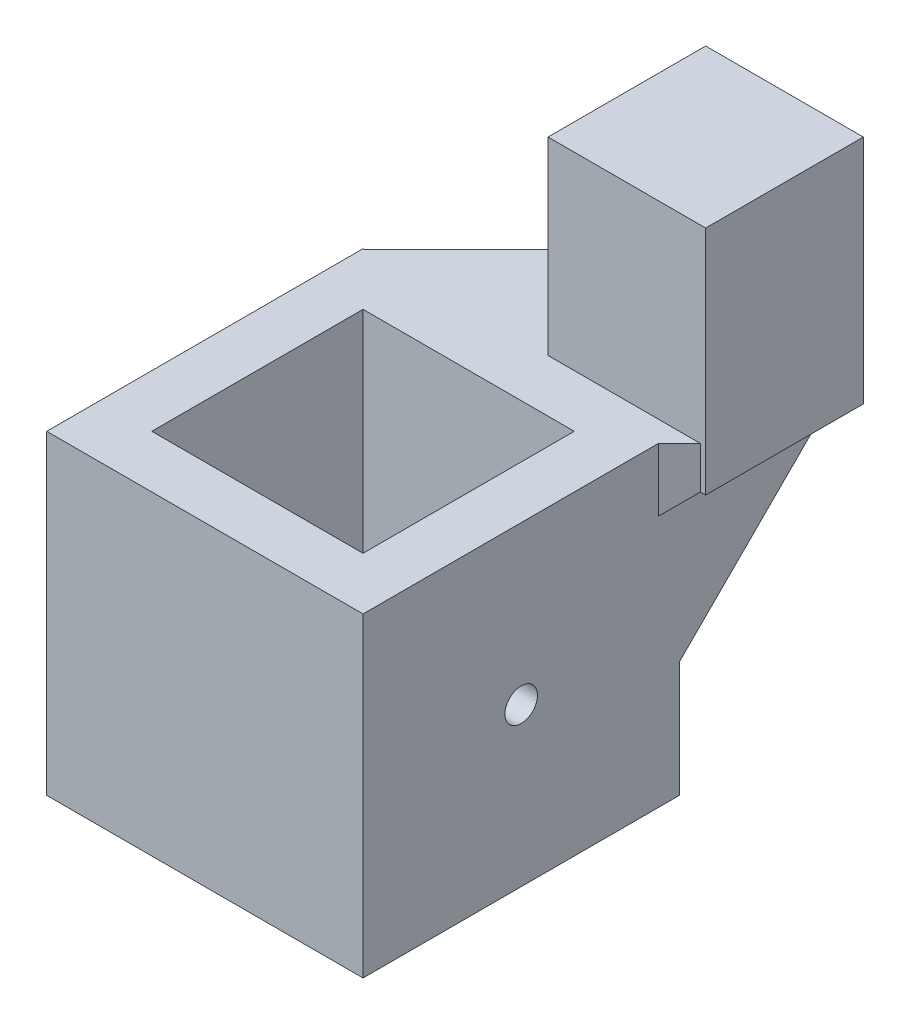
ISO-10303-21;
HEADER;
FILE_DESCRIPTION(('STEP AP214'),'2;1');
FILE_NAME('part.step','',(''),(''),'','','');
FILE_SCHEMA(('AUTOMOTIVE_DESIGN { 1 0 10303 214 1 1 1 1 }'));
ENDSEC;
DATA;
#1=APPLICATION_CONTEXT('core data for automotive mechanical design processes');
#2=APPLICATION_PROTOCOL_DEFINITION('international standard','automotive_design',2000,#1);
#3=PRODUCT_CONTEXT('',#1,'mechanical');
#4=PRODUCT('Part','Part','',(#3));
#5=PRODUCT_RELATED_PRODUCT_CATEGORY('part','',(#4));
#6=PRODUCT_DEFINITION_FORMATION('','',#4);
#7=PRODUCT_DEFINITION_CONTEXT('part definition',#1,'design');
#8=PRODUCT_DEFINITION('design','',#6,#7);
#9=PRODUCT_DEFINITION_SHAPE('','',#8);
#10=(LENGTH_UNIT() NAMED_UNIT(*) SI_UNIT(.MILLI.,.METRE.));
#11=(NAMED_UNIT(*) PLANE_ANGLE_UNIT() SI_UNIT($,.RADIAN.));
#12=(NAMED_UNIT(*) SI_UNIT($,.STERADIAN.) SOLID_ANGLE_UNIT());
#13=UNCERTAINTY_MEASURE_WITH_UNIT(LENGTH_MEASURE(1.E-05),#10,'distance_accuracy_value','');
#14=(GEOMETRIC_REPRESENTATION_CONTEXT(3) GLOBAL_UNCERTAINTY_ASSIGNED_CONTEXT((#13)) GLOBAL_UNIT_ASSIGNED_CONTEXT((#10,
#11,#12)) REPRESENTATION_CONTEXT('',''));
#15=CARTESIAN_POINT('',(0.,0.,0.));
#16=DIRECTION('',(0.,0.,1.));
#17=DIRECTION('',(1.,0.,0.));
#18=AXIS2_PLACEMENT_3D('',#15,#16,#17);
#19=CARTESIAN_POINT('',(0.,305.,-25.1));
#20=DIRECTION('',(0.,0.,1.));
#21=DIRECTION('',(1.,0.,0.));
#22=AXIS2_PLACEMENT_3D('',#19,#20,#21);
#23=PLANE('',#22);
#24=DIRECTION('',(1.,0.,0.));
#25=VECTOR('',#24,1.);
#26=CARTESIAN_POINT('',(0.,325.,-25.1));
#27=LINE('',#26,#25);
#28=CARTESIAN_POINT('',(-25.1,325.,-25.1));
#29=VERTEX_POINT('',#28);
#30=CARTESIAN_POINT('',(-25.0000000000001,325.,-25.1));
#31=VERTEX_POINT('',#30);
#32=EDGE_CURVE('E251',#29,#31,#27,.T.);
#33=ORIENTED_EDGE('',*,*,#32,.T.);
#34=DIRECTION('',(0.,-1.,0.));
#35=VECTOR('',#34,1.);
#36=CARTESIAN_POINT('',(-25.0000000000001,305.,-25.1));
#37=LINE('',#36,#35);
#38=CARTESIAN_POINT('',(-25.0000000000001,306.,-25.1));
#39=VERTEX_POINT('',#38);
#40=EDGE_CURVE('E298',#31,#39,#37,.T.);
#41=ORIENTED_EDGE('',*,*,#40,.T.);
#42=DIRECTION('',(1.,0.,0.));
#43=VECTOR('',#42,1.);
#44=CARTESIAN_POINT('',(0.,306.,-25.1));
#45=LINE('',#44,#43);
#46=CARTESIAN_POINT('',(5.,306.,-25.1));
#47=VERTEX_POINT('',#46);
#48=EDGE_CURVE('E275',#39,#47,#45,.T.);
#49=ORIENTED_EDGE('',*,*,#48,.T.);
#50=DIRECTION('',(0.,1.,0.));
#51=VECTOR('',#50,1.);
#52=CARTESIAN_POINT('',(5.,305.,-25.1));
#53=LINE('',#52,#51);
#54=CARTESIAN_POINT('',(5.,295.,-25.1));
#55=VERTEX_POINT('',#54);
#56=EDGE_CURVE('E272',#55,#47,#53,.T.);
#57=ORIENTED_EDGE('',*,*,#56,.F.);
#58=DIRECTION('',(1.,0.,0.));
#59=VECTOR('',#58,1.);
#60=CARTESIAN_POINT('',(0.,295.,-25.1));
#61=LINE('',#60,#59);
#62=CARTESIAN_POINT('',(-25.1,295.,-25.1));
#63=VERTEX_POINT('',#62);
#64=EDGE_CURVE('E228',#63,#55,#61,.T.);
#65=ORIENTED_EDGE('',*,*,#64,.F.);
#66=DIRECTION('',(0.,1.,0.));
#67=VECTOR('',#66,1.);
#68=CARTESIAN_POINT('',(-25.1,305.,-25.1));
#69=LINE('',#68,#67);
#70=EDGE_CURVE('E287',#63,#29,#69,.T.);
#71=ORIENTED_EDGE('',*,*,#70,.T.);
#72=EDGE_LOOP('',(#33,#41,#49,#57,#65,#71));
#73=FACE_BOUND('',#72,.T.);
#74=ADVANCED_FACE('F45',(#73),#23,.F.);
#75=CARTESIAN_POINT('',(0.,295.,0.));
#76=DIRECTION('',(0.,1.,0.));
#77=DIRECTION('',(0.,0.,1.));
#78=AXIS2_PLACEMENT_3D('',#75,#76,#77);
#79=PLANE('',#78);
#80=DIRECTION('',(0.,0.,1.));
#81=VECTOR('',#80,1.);
#82=CARTESIAN_POINT('',(5.,295.,0.));
#83=LINE('',#82,#81);
#84=CARTESIAN_POINT('',(5.,295.,5.));
#85=VERTEX_POINT('',#84);
#86=EDGE_CURVE('E225',#55,#85,#83,.T.);
#87=ORIENTED_EDGE('',*,*,#86,.T.);
#88=DIRECTION('',(1.,0.,0.));
#89=VECTOR('',#88,1.);
#90=CARTESIAN_POINT('',(0.,295.,5.));
#91=LINE('',#90,#89);
#92=CARTESIAN_POINT('',(-25.1,295.,5.));
#93=VERTEX_POINT('',#92);
#94=EDGE_CURVE('E234',#93,#85,#91,.T.);
#95=ORIENTED_EDGE('',*,*,#94,.F.);
#96=DIRECTION('',(0.,0.,1.));
#97=VECTOR('',#96,1.);
#98=CARTESIAN_POINT('',(-25.1,295.,0.));
#99=LINE('',#98,#97);
#100=EDGE_CURVE('E231',#63,#93,#99,.T.);
#101=ORIENTED_EDGE('',*,*,#100,.F.);
#102=ORIENTED_EDGE('',*,*,#64,.T.);
#103=EDGE_LOOP('',(#87,#95,#101,#102));
#104=FACE_BOUND('',#103,.T.);
#105=DIRECTION('',(1.,0.,0.));
#106=VECTOR('',#105,1.);
#107=CARTESIAN_POINT('',(0.,295.,-20.1));
#108=LINE('',#107,#106);
#109=CARTESIAN_POINT('',(-20.1,295.,-20.1));
#110=VERTEX_POINT('',#109);
#111=CARTESIAN_POINT('',(0.,295.,-20.1));
#112=VERTEX_POINT('',#111);
#113=EDGE_CURVE('E237',#110,#112,#108,.T.);
#114=ORIENTED_EDGE('',*,*,#113,.F.);
#115=DIRECTION('',(0.,0.,1.));
#116=VECTOR('',#115,1.);
#117=CARTESIAN_POINT('',(-20.1,295.,0.));
#118=LINE('',#117,#116);
#119=CARTESIAN_POINT('',(-20.1,295.,0.));
#120=VERTEX_POINT('',#119);
#121=EDGE_CURVE('E246',#110,#120,#118,.T.);
#122=ORIENTED_EDGE('',*,*,#121,.T.);
#123=DIRECTION('',(1.,0.,0.));
#124=VECTOR('',#123,1.);
#125=CARTESIAN_POINT('',(0.,295.,0.));
#126=LINE('',#125,#124);
#127=CARTESIAN_POINT('',(0.,295.,0.));
#128=VERTEX_POINT('',#127);
#129=EDGE_CURVE('E243',#120,#128,#126,.T.);
#130=ORIENTED_EDGE('',*,*,#129,.T.);
#131=DIRECTION('',(0.,0.,1.));
#132=VECTOR('',#131,1.);
#133=CARTESIAN_POINT('',(0.,295.,0.));
#134=LINE('',#133,#132);
#135=EDGE_CURVE('E240',#112,#128,#134,.T.);
#136=ORIENTED_EDGE('',*,*,#135,.F.);
#137=EDGE_LOOP('',(#114,#122,#130,#136));
#138=FACE_BOUND('',#137,.T.);
#139=ADVANCED_FACE('F340',(#104,#138),#79,.F.);
#140=CARTESIAN_POINT('',(-20.1,305.,0.));
#141=DIRECTION('',(-1.,0.,0.));
#142=DIRECTION('',(0.,0.,1.));
#143=AXIS2_PLACEMENT_3D('',#140,#141,#142);
#144=PLANE('',#143);
#145=CARTESIAN_POINT('',(-20.1,310.,-10.05));
#146=DIRECTION('',(-1.,0.,0.));
#147=DIRECTION('',(0.,0.,1.));
#148=AXIS2_PLACEMENT_3D('',#145,#146,#147);
#149=CIRCLE('',#148,1.55000000000003);
#150=CARTESIAN_POINT('',(-20.1,310.,-8.49999999999996));
#151=VERTEX_POINT('',#150);
#152=EDGE_CURVE('E222',#151,#151,#149,.T.);
#153=ORIENTED_EDGE('',*,*,#152,.T.);
#154=EDGE_LOOP('',(#153));
#155=FACE_BOUND('',#154,.T.);
#156=DIRECTION('',(0.,1.,0.));
#157=VECTOR('',#156,1.);
#158=CARTESIAN_POINT('',(-20.1,305.,-20.1));
#159=LINE('',#158,#157);
#160=CARTESIAN_POINT('',(-20.1,325.,-20.1));
#161=VERTEX_POINT('',#160);
#162=EDGE_CURVE('E273',#110,#161,#159,.T.);
#163=ORIENTED_EDGE('',*,*,#162,.T.);
#164=DIRECTION('',(0.,0.,1.));
#165=VECTOR('',#164,1.);
#166=CARTESIAN_POINT('',(-20.1,325.,0.));
#167=LINE('',#166,#165);
#168=CARTESIAN_POINT('',(-20.1,325.,0.));
#169=VERTEX_POINT('',#168);
#170=EDGE_CURVE('E269',#161,#169,#167,.T.);
#171=ORIENTED_EDGE('',*,*,#170,.T.);
#172=DIRECTION('',(0.,1.,0.));
#173=VECTOR('',#172,1.);
#174=CARTESIAN_POINT('',(-20.1,305.,0.));
#175=LINE('',#174,#173);
#176=EDGE_CURVE('E276',#120,#169,#175,.T.);
#177=ORIENTED_EDGE('',*,*,#176,.F.);
#178=ORIENTED_EDGE('',*,*,#121,.F.);
#179=EDGE_LOOP('',(#163,#171,#177,#178));
#180=FACE_BOUND('',#179,.T.);
#181=ADVANCED_FACE('F370',(#155,#180),#144,.F.);
#182=CARTESIAN_POINT('',(0.,305.,0.));
#183=DIRECTION('',(0.,0.,1.));
#184=DIRECTION('',(1.,0.,0.));
#185=AXIS2_PLACEMENT_3D('',#182,#183,#184);
#186=PLANE('',#185);
#187=ORIENTED_EDGE('',*,*,#176,.T.);
#188=DIRECTION('',(1.,0.,0.));
#189=VECTOR('',#188,1.);
#190=CARTESIAN_POINT('',(0.,325.,0.));
#191=LINE('',#190,#189);
#192=CARTESIAN_POINT('',(0.,325.,0.));
#193=VERTEX_POINT('',#192);
#194=EDGE_CURVE('E266',#169,#193,#191,.T.);
#195=ORIENTED_EDGE('',*,*,#194,.T.);
#196=DIRECTION('',(0.,1.,0.));
#197=VECTOR('',#196,1.);
#198=CARTESIAN_POINT('',(0.,305.,0.));
#199=LINE('',#198,#197);
#200=EDGE_CURVE('E278',#128,#193,#199,.T.);
#201=ORIENTED_EDGE('',*,*,#200,.F.);
#202=ORIENTED_EDGE('',*,*,#129,.F.);
#203=EDGE_LOOP('',(#187,#195,#201,#202));
#204=FACE_BOUND('',#203,.T.);
#205=ADVANCED_FACE('F517',(#204),#186,.F.);
#206=CARTESIAN_POINT('',(0.,305.,0.));
#207=DIRECTION('',(-1.,0.,0.));
#208=DIRECTION('',(0.,0.,1.));
#209=AXIS2_PLACEMENT_3D('',#206,#207,#208);
#210=PLANE('',#209);
#211=CARTESIAN_POINT('',(0.,310.,-10.05));
#212=DIRECTION('',(-1.,0.,0.));
#213=DIRECTION('',(0.,0.,1.));
#214=AXIS2_PLACEMENT_3D('',#211,#212,#213);
#215=CIRCLE('',#214,1.55000000000003);
#216=CARTESIAN_POINT('',(0.,310.,-8.49999999999997));
#217=VERTEX_POINT('',#216);
#218=EDGE_CURVE('E219',#217,#217,#215,.T.);
#219=ORIENTED_EDGE('',*,*,#218,.F.);
#220=EDGE_LOOP('',(#219));
#221=FACE_BOUND('',#220,.T.);
#222=ORIENTED_EDGE('',*,*,#200,.T.);
#223=DIRECTION('',(0.,0.,1.));
#224=VECTOR('',#223,1.);
#225=CARTESIAN_POINT('',(0.,325.,0.));
#226=LINE('',#225,#224);
#227=CARTESIAN_POINT('',(0.,325.,-20.1));
#228=VERTEX_POINT('',#227);
#229=EDGE_CURVE('E263',#228,#193,#226,.T.);
#230=ORIENTED_EDGE('',*,*,#229,.F.);
#231=DIRECTION('',(0.,1.,0.));
#232=VECTOR('',#231,1.);
#233=CARTESIAN_POINT('',(0.,305.,-20.1));
#234=LINE('',#233,#232);
#235=EDGE_CURVE('E280',#112,#228,#234,.T.);
#236=ORIENTED_EDGE('',*,*,#235,.F.);
#237=ORIENTED_EDGE('',*,*,#135,.T.);
#238=EDGE_LOOP('',(#222,#230,#236,#237));
#239=FACE_BOUND('',#238,.T.);
#240=ADVANCED_FACE('F513',(#221,#239),#210,.T.);
#241=CARTESIAN_POINT('',(0.,305.,-20.1));
#242=DIRECTION('',(0.,0.,1.));
#243=DIRECTION('',(1.,0.,0.));
#244=AXIS2_PLACEMENT_3D('',#241,#242,#243);
#245=PLANE('',#244);
#246=ORIENTED_EDGE('',*,*,#235,.T.);
#247=DIRECTION('',(1.,0.,0.));
#248=VECTOR('',#247,1.);
#249=CARTESIAN_POINT('',(0.,325.,-20.1));
#250=LINE('',#249,#248);
#251=EDGE_CURVE('E260',#161,#228,#250,.T.);
#252=ORIENTED_EDGE('',*,*,#251,.F.);
#253=ORIENTED_EDGE('',*,*,#162,.F.);
#254=ORIENTED_EDGE('',*,*,#113,.T.);
#255=EDGE_LOOP('',(#246,#252,#253,#254));
#256=FACE_BOUND('',#255,.T.);
#257=ADVANCED_FACE('F436',(#256),#245,.T.);
#258=CARTESIAN_POINT('',(0.,325.,0.));
#259=DIRECTION('',(0.,1.,0.));
#260=DIRECTION('',(0.,0.,1.));
#261=AXIS2_PLACEMENT_3D('',#258,#259,#260);
#262=PLANE('',#261);
#263=DIRECTION('',(1.,0.,0.));
#264=VECTOR('',#263,1.);
#265=CARTESIAN_POINT('',(0.,325.,-25.1));
#266=LINE('',#265,#264);
#267=CARTESIAN_POINT('',(-7.5,325.,-25.1));
#268=VERTEX_POINT('',#267);
#269=CARTESIAN_POINT('',(7.00000000000001,325.,-25.1));
#270=VERTEX_POINT('',#269);
#271=EDGE_CURVE('E69',#268,#270,#266,.T.);
#272=ORIENTED_EDGE('',*,*,#271,.F.);
#273=DIRECTION('',(0.,0.,1.));
#274=VECTOR('',#273,1.);
#275=CARTESIAN_POINT('',(-7.5,325.,0.));
#276=LINE('',#275,#274);
#277=CARTESIAN_POINT('',(-7.5,325.,-40.1));
#278=VERTEX_POINT('',#277);
#279=EDGE_CURVE('E198',#278,#268,#276,.T.);
#280=ORIENTED_EDGE('',*,*,#279,.F.);
#281=DIRECTION('',(-1.,0.,0.));
#282=VECTOR('',#281,1.);
#283=CARTESIAN_POINT('',(7.5,325.,-40.1));
#284=LINE('',#283,#282);
#285=CARTESIAN_POINT('',(-10.,325.,-40.1));
#286=VERTEX_POINT('',#285);
#287=EDGE_CURVE('E204',#278,#286,#284,.T.);
#288=ORIENTED_EDGE('',*,*,#287,.T.);
#289=DIRECTION('',(-0.707106781186543,0.,0.707106781186552));
#290=VECTOR('',#289,1.);
#291=CARTESIAN_POINT('',(-10.,325.,-40.1000000000003));
#292=LINE('',#291,#290);
#293=EDGE_CURVE('E301',#286,#31,#292,.T.);
#294=ORIENTED_EDGE('',*,*,#293,.T.);
#295=ORIENTED_EDGE('',*,*,#32,.F.);
#296=DIRECTION('',(0.,0.,1.));
#297=VECTOR('',#296,1.);
#298=CARTESIAN_POINT('',(-25.1,325.,0.));
#299=LINE('',#298,#297);
#300=CARTESIAN_POINT('',(-25.1,325.,5.));
#301=VERTEX_POINT('',#300);
#302=EDGE_CURVE('E254',#29,#301,#299,.T.);
#303=ORIENTED_EDGE('',*,*,#302,.T.);
#304=DIRECTION('',(1.,0.,0.));
#305=VECTOR('',#304,1.);
#306=CARTESIAN_POINT('',(0.,325.,5.));
#307=LINE('',#306,#305);
#308=CARTESIAN_POINT('',(5.,325.,5.));
#309=VERTEX_POINT('',#308);
#310=EDGE_CURVE('E257',#301,#309,#307,.T.);
#311=ORIENTED_EDGE('',*,*,#310,.T.);
#312=DIRECTION('',(0.,0.,1.));
#313=VECTOR('',#312,1.);
#314=CARTESIAN_POINT('',(5.,325.,0.));
#315=LINE('',#314,#313);
#316=CARTESIAN_POINT('',(5.,325.,-23.1));
#317=VERTEX_POINT('',#316);
#318=EDGE_CURVE('E249',#317,#309,#315,.T.);
#319=ORIENTED_EDGE('',*,*,#318,.F.);
#320=DIRECTION('',(0.707106781186549,0.,-0.707106781186546));
#321=VECTOR('',#320,1.);
#322=CARTESIAN_POINT('',(5.,325.,-23.1));
#323=LINE('',#322,#321);
#324=EDGE_CURVE('E55',#317,#270,#323,.T.);
#325=ORIENTED_EDGE('',*,*,#324,.T.);
#326=EDGE_LOOP('',(#272,#280,#288,#294,#295,#303,#311,#319,#325));
#327=FACE_BOUND('',#326,.T.);
#328=ORIENTED_EDGE('',*,*,#251,.T.);
#329=ORIENTED_EDGE('',*,*,#229,.T.);
#330=ORIENTED_EDGE('',*,*,#194,.F.);
#331=ORIENTED_EDGE('',*,*,#170,.F.);
#332=EDGE_LOOP('',(#328,#329,#330,#331));
#333=FACE_BOUND('',#332,.T.);
#334=ADVANCED_FACE('F317',(#327,#333),#262,.T.);
#335=CARTESIAN_POINT('',(5.,305.,0.));
#336=DIRECTION('',(-1.,0.,0.));
#337=DIRECTION('',(0.,0.,1.));
#338=AXIS2_PLACEMENT_3D('',#335,#336,#337);
#339=PLANE('',#338);
#340=CARTESIAN_POINT('',(5.,310.,-10.05));
#341=DIRECTION('',(1.,0.,0.));
#342=DIRECTION('',(0.,0.,-1.));
#343=AXIS2_PLACEMENT_3D('',#340,#341,#342);
#344=CIRCLE('',#343,1.55000000000003);
#345=CARTESIAN_POINT('',(5.,310.,-11.6));
#346=VERTEX_POINT('',#345);
#347=EDGE_CURVE('E213',#346,#346,#344,.T.);
#348=ORIENTED_EDGE('',*,*,#347,.F.);
#349=EDGE_LOOP('',(#348));
#350=FACE_BOUND('',#349,.T.);
#351=DIRECTION('',(0.,0.,1.));
#352=VECTOR('',#351,1.);
#353=CARTESIAN_POINT('',(5.,319.,0.));
#354=LINE('',#353,#352);
#355=CARTESIAN_POINT('',(5.,319.,-38.1));
#356=VERTEX_POINT('',#355);
#357=CARTESIAN_POINT('',(5.,319.,-23.1));
#358=VERTEX_POINT('',#357);
#359=EDGE_CURVE('E305',#356,#358,#354,.T.);
#360=ORIENTED_EDGE('',*,*,#359,.T.);
#361=DIRECTION('',(0.,1.,0.));
#362=VECTOR('',#361,1.);
#363=CARTESIAN_POINT('',(5.,305.,-23.1));
#364=LINE('',#363,#362);
#365=EDGE_CURVE('E307',#358,#317,#364,.T.);
#366=ORIENTED_EDGE('',*,*,#365,.T.);
#367=ORIENTED_EDGE('',*,*,#318,.T.);
#368=DIRECTION('',(0.,1.,0.));
#369=VECTOR('',#368,1.);
#370=CARTESIAN_POINT('',(5.,305.,5.));
#371=LINE('',#370,#369);
#372=EDGE_CURVE('E282',#85,#309,#371,.T.);
#373=ORIENTED_EDGE('',*,*,#372,.F.);
#374=ORIENTED_EDGE('',*,*,#86,.F.);
#375=ORIENTED_EDGE('',*,*,#56,.T.);
#376=DIRECTION('',(0.,0.707106781186551,-0.707106781186544));
#377=VECTOR('',#376,1.);
#378=CARTESIAN_POINT('',(5.,292.95,-12.0500000000001));
#379=LINE('',#378,#377);
#380=EDGE_CURVE('E295',#47,#356,#379,.T.);
#381=ORIENTED_EDGE('',*,*,#380,.T.);
#382=EDGE_LOOP('',(#360,#366,#367,#373,#374,#375,#381));
#383=FACE_BOUND('',#382,.T.);
#384=ADVANCED_FACE('F334',(#350,#383),#339,.F.);
#385=CARTESIAN_POINT('',(0.,305.,5.));
#386=DIRECTION('',(0.,0.,1.));
#387=DIRECTION('',(1.,0.,0.));
#388=AXIS2_PLACEMENT_3D('',#385,#386,#387);
#389=PLANE('',#388);
#390=ORIENTED_EDGE('',*,*,#372,.T.);
#391=ORIENTED_EDGE('',*,*,#310,.F.);
#392=DIRECTION('',(0.,1.,0.));
#393=VECTOR('',#392,1.);
#394=CARTESIAN_POINT('',(-25.1,305.,5.));
#395=LINE('',#394,#393);
#396=EDGE_CURVE('E285',#93,#301,#395,.T.);
#397=ORIENTED_EDGE('',*,*,#396,.F.);
#398=ORIENTED_EDGE('',*,*,#94,.T.);
#399=EDGE_LOOP('',(#390,#391,#397,#398));
#400=FACE_BOUND('',#399,.T.);
#401=ADVANCED_FACE('F377',(#400),#389,.T.);
#402=CARTESIAN_POINT('',(-25.1,305.,0.));
#403=DIRECTION('',(-1.,0.,0.));
#404=DIRECTION('',(0.,0.,1.));
#405=AXIS2_PLACEMENT_3D('',#402,#403,#404);
#406=PLANE('',#405);
#407=CARTESIAN_POINT('',(-25.1,310.,-10.05));
#408=DIRECTION('',(-1.,0.,0.));
#409=DIRECTION('',(0.,0.,1.));
#410=AXIS2_PLACEMENT_3D('',#407,#408,#409);
#411=CIRCLE('',#410,1.55000000000003);
#412=CARTESIAN_POINT('',(-25.1,310.,-8.49999999999996));
#413=VERTEX_POINT('',#412);
#414=EDGE_CURVE('E218',#413,#413,#411,.T.);
#415=ORIENTED_EDGE('',*,*,#414,.F.);
#416=EDGE_LOOP('',(#415));
#417=FACE_BOUND('',#416,.T.);
#418=ORIENTED_EDGE('',*,*,#396,.T.);
#419=ORIENTED_EDGE('',*,*,#302,.F.);
#420=ORIENTED_EDGE('',*,*,#70,.F.);
#421=ORIENTED_EDGE('',*,*,#100,.T.);
#422=EDGE_LOOP('',(#418,#419,#420,#421));
#423=FACE_BOUND('',#422,.T.);
#424=ADVANCED_FACE('F344',(#417,#423),#406,.T.);
#425=CARTESIAN_POINT('',(-49.,310.,-10.05));
#426=DIRECTION('',(1.,0.,0.));
#427=DIRECTION('',(0.,0.,-1.));
#428=AXIS2_PLACEMENT_3D('',#425,#426,#427);
#429=CYLINDRICAL_SURFACE('',#428,1.55000000000003);
#430=ORIENTED_EDGE('',*,*,#414,.T.);
#431=EDGE_LOOP('',(#430));
#432=FACE_BOUND('',#431,.T.);
#433=ORIENTED_EDGE('',*,*,#152,.F.);
#434=EDGE_LOOP('',(#433));
#435=FACE_BOUND('',#434,.T.);
#436=ADVANCED_FACE('F487',(#432,#435),#429,.F.);
#437=ORIENTED_EDGE('',*,*,#218,.T.);
#438=EDGE_LOOP('',(#437));
#439=FACE_BOUND('',#438,.T.);
#440=ORIENTED_EDGE('',*,*,#347,.T.);
#441=EDGE_LOOP('',(#440));
#442=FACE_BOUND('',#441,.T.);
#443=ADVANCED_FACE('F421',(#439,#442),#429,.F.);
#444=CARTESIAN_POINT('',(7.5,321.,-25.1));
#445=DIRECTION('',(0.,0.,1.));
#446=DIRECTION('',(1.,0.,0.));
#447=AXIS2_PLACEMENT_3D('',#444,#445,#446);
#448=PLANE('',#447);
#449=ORIENTED_EDGE('',*,*,#271,.T.);
#450=DIRECTION('',(0.,-1.,0.));
#451=VECTOR('',#450,1.);
#452=CARTESIAN_POINT('',(7.00000000000001,321.,-25.1));
#453=LINE('',#452,#451);
#454=CARTESIAN_POINT('',(7.00000000000001,321.,-25.1));
#455=VERTEX_POINT('',#454);
#456=EDGE_CURVE('E310',#270,#455,#453,.T.);
#457=ORIENTED_EDGE('',*,*,#456,.T.);
#458=DIRECTION('',(1.,0.,0.));
#459=VECTOR('',#458,1.);
#460=CARTESIAN_POINT('',(7.5,321.,-25.1));
#461=LINE('',#460,#459);
#462=CARTESIAN_POINT('',(7.5,321.,-25.1));
#463=VERTEX_POINT('',#462);
#464=EDGE_CURVE('E177',#455,#463,#461,.T.);
#465=ORIENTED_EDGE('',*,*,#464,.T.);
#466=DIRECTION('',(0.,1.,0.));
#467=VECTOR('',#466,1.);
#468=CARTESIAN_POINT('',(7.5,321.,-25.1));
#469=LINE('',#468,#467);
#470=CARTESIAN_POINT('',(7.5,343.,-25.1));
#471=VERTEX_POINT('',#470);
#472=EDGE_CURVE('E211',#463,#471,#469,.T.);
#473=ORIENTED_EDGE('',*,*,#472,.T.);
#474=DIRECTION('',(1.,0.,0.));
#475=VECTOR('',#474,1.);
#476=CARTESIAN_POINT('',(0.,343.,-25.1));
#477=LINE('',#476,#475);
#478=CARTESIAN_POINT('',(-7.5,343.,-25.1));
#479=VERTEX_POINT('',#478);
#480=EDGE_CURVE('E185',#479,#471,#477,.T.);
#481=ORIENTED_EDGE('',*,*,#480,.F.);
#482=DIRECTION('',(0.,-1.,0.));
#483=VECTOR('',#482,1.);
#484=CARTESIAN_POINT('',(-7.5,343.,-25.1));
#485=LINE('',#484,#483);
#486=EDGE_CURVE('E197',#479,#268,#485,.T.);
#487=ORIENTED_EDGE('',*,*,#486,.T.);
#488=EDGE_LOOP('',(#449,#457,#465,#473,#481,#487));
#489=FACE_BOUND('',#488,.T.);
#490=ADVANCED_FACE('F325',(#489),#448,.T.);
#491=CARTESIAN_POINT('',(7.5,321.,-40.1));
#492=DIRECTION('',(1.,0.,0.));
#493=DIRECTION('',(0.,0.,-1.));
#494=AXIS2_PLACEMENT_3D('',#491,#492,#493);
#495=PLANE('',#494);
#496=DIRECTION('',(0.,1.,0.));
#497=VECTOR('',#496,1.);
#498=CARTESIAN_POINT('',(7.5,321.,-40.1));
#499=LINE('',#498,#497);
#500=CARTESIAN_POINT('',(7.5,321.,-40.1));
#501=VERTEX_POINT('',#500);
#502=CARTESIAN_POINT('',(7.5,343.,-40.1));
#503=VERTEX_POINT('',#502);
#504=EDGE_CURVE('E165',#501,#503,#499,.T.);
#505=ORIENTED_EDGE('',*,*,#504,.T.);
#506=DIRECTION('',(0.,0.,1.));
#507=VECTOR('',#506,1.);
#508=CARTESIAN_POINT('',(7.5,343.,0.));
#509=LINE('',#508,#507);
#510=EDGE_CURVE('E169',#503,#471,#509,.T.);
#511=ORIENTED_EDGE('',*,*,#510,.T.);
#512=ORIENTED_EDGE('',*,*,#472,.F.);
#513=DIRECTION('',(0.,0.,-1.));
#514=VECTOR('',#513,1.);
#515=CARTESIAN_POINT('',(7.5,321.,-40.1));
#516=LINE('',#515,#514);
#517=EDGE_CURVE('E171',#463,#501,#516,.T.);
#518=ORIENTED_EDGE('',*,*,#517,.T.);
#519=EDGE_LOOP('',(#505,#511,#512,#518));
#520=FACE_BOUND('',#519,.T.);
#521=ADVANCED_FACE('F167',(#520),#495,.T.);
#522=CARTESIAN_POINT('',(7.5,321.,-40.1));
#523=DIRECTION('',(0.,0.,-1.));
#524=DIRECTION('',(-1.,0.,0.));
#525=AXIS2_PLACEMENT_3D('',#522,#523,#524);
#526=PLANE('',#525);
#527=ORIENTED_EDGE('',*,*,#287,.F.);
#528=DIRECTION('',(0.,-1.,0.));
#529=VECTOR('',#528,1.);
#530=CARTESIAN_POINT('',(-7.5,343.,-40.1));
#531=LINE('',#530,#529);
#532=CARTESIAN_POINT('',(-7.5,343.,-40.1));
#533=VERTEX_POINT('',#532);
#534=EDGE_CURVE('E190',#533,#278,#531,.T.);
#535=ORIENTED_EDGE('',*,*,#534,.F.);
#536=DIRECTION('',(1.,0.,0.));
#537=VECTOR('',#536,1.);
#538=CARTESIAN_POINT('',(0.,343.,-40.1));
#539=LINE('',#538,#537);
#540=EDGE_CURVE('E183',#533,#503,#539,.T.);
#541=ORIENTED_EDGE('',*,*,#540,.T.);
#542=ORIENTED_EDGE('',*,*,#504,.F.);
#543=DIRECTION('',(-1.,0.,0.));
#544=VECTOR('',#543,1.);
#545=CARTESIAN_POINT('',(7.5,321.,-40.1));
#546=LINE('',#545,#544);
#547=CARTESIAN_POINT('',(7.00000000000001,321.,-40.1));
#548=VERTEX_POINT('',#547);
#549=EDGE_CURVE('E206',#501,#548,#546,.T.);
#550=ORIENTED_EDGE('',*,*,#549,.T.);
#551=CARTESIAN_POINT('',(-10.,321.,-40.1));
#552=VERTEX_POINT('',#551);
#553=EDGE_CURVE('E61',#548,#552,#546,.T.);
#554=ORIENTED_EDGE('',*,*,#553,.T.);
#555=DIRECTION('',(0.,1.,0.));
#556=VECTOR('',#555,1.);
#557=CARTESIAN_POINT('',(-10.,321.,-40.1));
#558=LINE('',#557,#556);
#559=EDGE_CURVE('E176',#552,#286,#558,.T.);
#560=ORIENTED_EDGE('',*,*,#559,.T.);
#561=EDGE_LOOP('',(#527,#535,#541,#542,#550,#554,#560));
#562=FACE_BOUND('',#561,.T.);
#563=ADVANCED_FACE('F188',(#562),#526,.T.);
#564=CARTESIAN_POINT('',(0.,321.,0.));
#565=DIRECTION('',(0.,-1.,0.));
#566=DIRECTION('',(0.,0.,-1.));
#567=AXIS2_PLACEMENT_3D('',#564,#565,#566);
#568=PLANE('',#567);
#569=ORIENTED_EDGE('',*,*,#464,.F.);
#570=DIRECTION('',(0.,0.,-1.));
#571=VECTOR('',#570,1.);
#572=CARTESIAN_POINT('',(7.00000000000001,321.,0.));
#573=LINE('',#572,#571);
#574=EDGE_CURVE('E312',#455,#548,#573,.T.);
#575=ORIENTED_EDGE('',*,*,#574,.T.);
#576=ORIENTED_EDGE('',*,*,#549,.F.);
#577=ORIENTED_EDGE('',*,*,#517,.F.);
#578=EDGE_LOOP('',(#569,#575,#576,#577));
#579=FACE_BOUND('',#578,.T.);
#580=ADVANCED_FACE('F328',(#579),#568,.T.);
#581=CARTESIAN_POINT('',(-7.5,343.,0.));
#582=DIRECTION('',(1.,0.,0.));
#583=DIRECTION('',(0.,0.,-1.));
#584=AXIS2_PLACEMENT_3D('',#581,#582,#583);
#585=PLANE('',#584);
#586=ORIENTED_EDGE('',*,*,#279,.T.);
#587=ORIENTED_EDGE('',*,*,#486,.F.);
#588=DIRECTION('',(0.,0.,1.));
#589=VECTOR('',#588,1.);
#590=CARTESIAN_POINT('',(-7.5,343.,0.));
#591=LINE('',#590,#589);
#592=EDGE_CURVE('E192',#533,#479,#591,.T.);
#593=ORIENTED_EDGE('',*,*,#592,.F.);
#594=ORIENTED_EDGE('',*,*,#534,.T.);
#595=EDGE_LOOP('',(#586,#587,#593,#594));
#596=FACE_BOUND('',#595,.T.);
#597=ADVANCED_FACE('F353',(#596),#585,.F.);
#598=CARTESIAN_POINT('',(0.,343.,0.));
#599=DIRECTION('',(0.,1.,0.));
#600=DIRECTION('',(0.,0.,1.));
#601=AXIS2_PLACEMENT_3D('',#598,#599,#600);
#602=PLANE('',#601);
#603=ORIENTED_EDGE('',*,*,#510,.F.);
#604=ORIENTED_EDGE('',*,*,#540,.F.);
#605=ORIENTED_EDGE('',*,*,#592,.T.);
#606=ORIENTED_EDGE('',*,*,#480,.T.);
#607=EDGE_LOOP('',(#603,#604,#605,#606));
#608=FACE_BOUND('',#607,.T.);
#609=ADVANCED_FACE('F182',(#608),#602,.T.);
#610=CARTESIAN_POINT('',(0.,306.,-25.1));
#611=DIRECTION('',(0.,0.707106781186544,0.707106781186551));
#612=DIRECTION('',(1.,0.,0.));
#613=AXIS2_PLACEMENT_3D('',#610,#611,#612);
#614=PLANE('',#613);
#615=ORIENTED_EDGE('',*,*,#48,.F.);
#616=DIRECTION('',(0.57735026918962,0.577350269189631,-0.577350269189626));
#617=VECTOR('',#616,1.);
#618=CARTESIAN_POINT('',(-16.6666666666669,314.333333333333,-33.4333333333333));
#619=LINE('',#618,#617);
#620=EDGE_CURVE('E303',#39,#552,#619,.T.);
#621=ORIENTED_EDGE('',*,*,#620,.T.);
#622=ORIENTED_EDGE('',*,*,#553,.F.);
#623=DIRECTION('',(-0.577350269189629,-0.577350269189627,0.577350269189622));
#624=VECTOR('',#623,1.);
#625=CARTESIAN_POINT('',(-5.33333333333338,308.666666666667,-27.7666666666667));
#626=LINE('',#625,#624);
#627=EDGE_CURVE('E11',#548,#356,#626,.T.);
#628=ORIENTED_EDGE('',*,*,#627,.T.);
#629=ORIENTED_EDGE('',*,*,#380,.F.);
#630=EDGE_LOOP('',(#615,#621,#622,#628,#629));
#631=FACE_BOUND('',#630,.T.);
#632=ADVANCED_FACE('F332',(#631),#614,.F.);
#633=CARTESIAN_POINT('',(-10.,321.,-40.1000000000003));
#634=DIRECTION('',(0.707106781186552,0.,0.707106781186543));
#635=DIRECTION('',(0.,1.,0.));
#636=AXIS2_PLACEMENT_3D('',#633,#634,#635);
#637=PLANE('',#636);
#638=ORIENTED_EDGE('',*,*,#620,.F.);
#639=ORIENTED_EDGE('',*,*,#40,.F.);
#640=ORIENTED_EDGE('',*,*,#293,.F.);
#641=ORIENTED_EDGE('',*,*,#559,.F.);
#642=EDGE_LOOP('',(#638,#639,#640,#641));
#643=FACE_BOUND('',#642,.T.);
#644=ADVANCED_FACE('F350',(#643),#637,.F.);
#645=CARTESIAN_POINT('',(7.00000000000001,321.,0.));
#646=DIRECTION('',(-0.707106781186546,0.707106781186549,0.));
#647=DIRECTION('',(0.,0.,-1.));
#648=AXIS2_PLACEMENT_3D('',#645,#646,#647);
#649=PLANE('',#648);
#650=ORIENTED_EDGE('',*,*,#627,.F.);
#651=ORIENTED_EDGE('',*,*,#574,.F.);
#652=DIRECTION('',(-0.577350269189627,-0.577350269189625,0.577350269189625));
#653=VECTOR('',#652,1.);
#654=CARTESIAN_POINT('',(-1.36666666666666,312.633333333333,-16.7333333333334));
#655=LINE('',#654,#653);
#656=EDGE_CURVE('E50',#358,#455,#655,.F.);
#657=ORIENTED_EDGE('',*,*,#656,.F.);
#658=ORIENTED_EDGE('',*,*,#359,.F.);
#659=EDGE_LOOP('',(#650,#651,#657,#658));
#660=FACE_BOUND('',#659,.T.);
#661=ADVANCED_FACE('F48',(#660),#649,.F.);
#662=CARTESIAN_POINT('',(5.,305.,-23.1));
#663=DIRECTION('',(-0.707106781186546,0.,-0.707106781186549));
#664=DIRECTION('',(0.,1.,0.));
#665=AXIS2_PLACEMENT_3D('',#662,#663,#664);
#666=PLANE('',#665);
#667=ORIENTED_EDGE('',*,*,#656,.T.);
#668=ORIENTED_EDGE('',*,*,#456,.F.);
#669=ORIENTED_EDGE('',*,*,#324,.F.);
#670=ORIENTED_EDGE('',*,*,#365,.F.);
#671=EDGE_LOOP('',(#667,#668,#669,#670));
#672=FACE_BOUND('',#671,.T.);
#673=ADVANCED_FACE('F322',(#672),#666,.F.);
#674=CLOSED_SHELL('',(#74,#139,#181,#205,#240,#257,#334,#384,#401,#424,#436,#443,#490,#521,#563,
#580,#597,#609,#632,#644,#661,#673));
#675=MANIFOLD_SOLID_BREP('B2',#674);
#676=ADVANCED_BREP_SHAPE_REPRESENTATION('',(#18,#675),#14);
#677=SHAPE_DEFINITION_REPRESENTATION(#9,#676);
ENDSEC;
END-ISO-10303-21;
